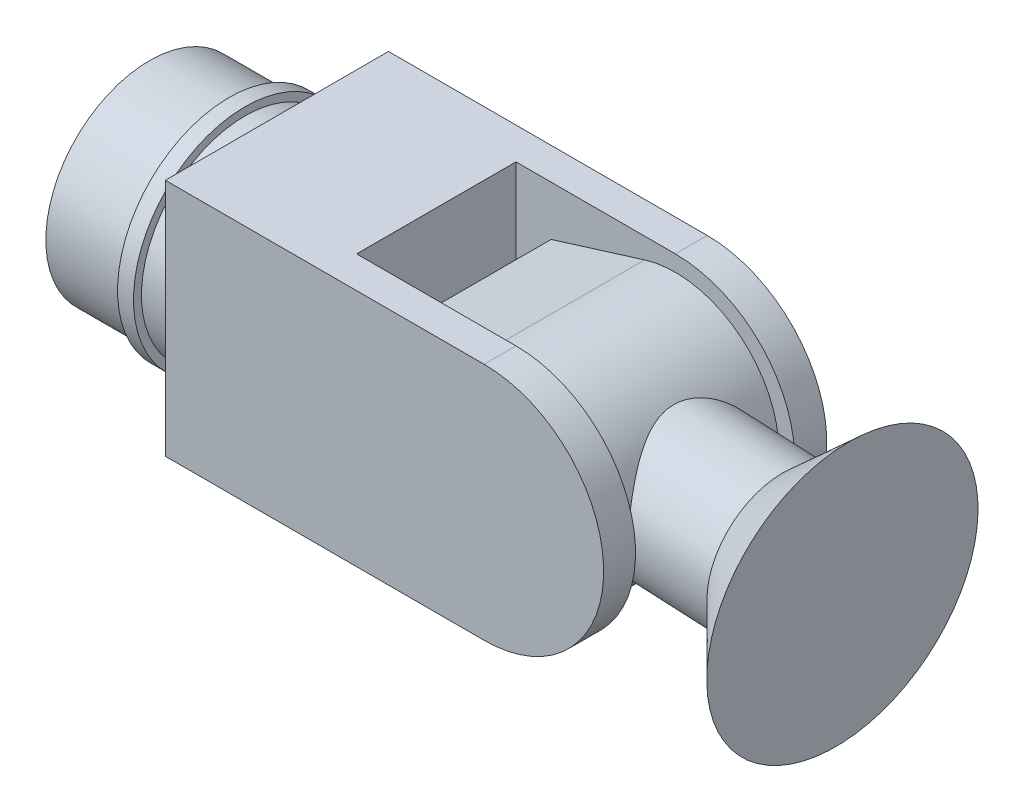
ISO-10303-21;
HEADER;
FILE_DESCRIPTION(('STEP AP214'),'2;1');
FILE_NAME('part.step','',(''),(''),'','','');
FILE_SCHEMA(('AUTOMOTIVE_DESIGN { 1 0 10303 214 1 1 1 1 }'));
ENDSEC;
DATA;
#1=APPLICATION_CONTEXT('core data for automotive mechanical design processes');
#2=APPLICATION_PROTOCOL_DEFINITION('international standard','automotive_design',2000,#1);
#3=PRODUCT_CONTEXT('',#1,'mechanical');
#4=PRODUCT('Part','Part','',(#3));
#5=PRODUCT_RELATED_PRODUCT_CATEGORY('part','',(#4));
#6=PRODUCT_DEFINITION_FORMATION('','',#4);
#7=PRODUCT_DEFINITION_CONTEXT('part definition',#1,'design');
#8=PRODUCT_DEFINITION('design','',#6,#7);
#9=PRODUCT_DEFINITION_SHAPE('','',#8);
#10=(LENGTH_UNIT() NAMED_UNIT(*) SI_UNIT(.MILLI.,.METRE.));
#11=(NAMED_UNIT(*) PLANE_ANGLE_UNIT() SI_UNIT($,.RADIAN.));
#12=(NAMED_UNIT(*) SI_UNIT($,.STERADIAN.) SOLID_ANGLE_UNIT());
#13=UNCERTAINTY_MEASURE_WITH_UNIT(LENGTH_MEASURE(1.E-05),#10,'distance_accuracy_value','');
#14=(GEOMETRIC_REPRESENTATION_CONTEXT(3) GLOBAL_UNCERTAINTY_ASSIGNED_CONTEXT((#13)) GLOBAL_UNIT_ASSIGNED_CONTEXT((#10,
#11,#12)) REPRESENTATION_CONTEXT('',''));
#15=CARTESIAN_POINT('',(0.,0.,0.));
#16=DIRECTION('',(0.,0.,1.));
#17=DIRECTION('',(1.,0.,0.));
#18=AXIS2_PLACEMENT_3D('',#15,#16,#17);
#19=CARTESIAN_POINT('',(8.33823827862884,219.613130495123,295.903382637009));
#20=DIRECTION('',(0.998805605156497,-0.0488606498929882,0.));
#21=DIRECTION('',(0.,0.,-1.));
#22=AXIS2_PLACEMENT_3D('',#19,#20,#21);
#23=CYLINDRICAL_SURFACE('',#22,45.);
#24=CARTESIAN_POINT('',(153.167048637531,212.52823853934,250.903382637009));
#25=CARTESIAN_POINT('',(153.221845720074,213.64837230147,250.903381434481));
#26=CARTESIAN_POINT('',(153.247590342564,214.769910112565,250.945362476761));
#27=CARTESIAN_POINT('',(153.241257132824,217.00654567177,251.11259702764));
#28=CARTESIAN_POINT('',(153.209180621804,218.121643566449,251.237848633472));
#29=CARTESIAN_POINT('',(153.088871896757,220.336936492757,251.56970544904));
#30=CARTESIAN_POINT('',(153.000619944654,221.437126147333,251.776339243885));
#31=CARTESIAN_POINT('',(152.770885842939,223.614145863468,252.267906623606));
#32=CARTESIAN_POINT('',(152.62940266399,224.690975472886,252.552841722571));
#33=CARTESIAN_POINT('',(152.297998754639,226.808970229751,253.195580907304));
#34=CARTESIAN_POINT('',(152.10832112387,227.850285464563,253.553017511861));
#35=CARTESIAN_POINT('',(151.684854828218,229.897032701845,254.33740632832));
#36=CARTESIAN_POINT('',(151.451066457131,230.902464943257,254.76435807722));
#37=CARTESIAN_POINT('',(150.944551164916,232.872800372865,255.683440639925));
#38=CARTESIAN_POINT('',(150.671824588411,233.837703919662,256.175570876865));
#39=CARTESIAN_POINT('',(150.092923633605,235.723377351507,257.220817886029));
#40=CARTESIAN_POINT('',(149.786747619552,236.644145075044,257.773937640789));
#41=CARTESIAN_POINT('',(149.118619402197,238.517276609906,258.988208875215));
#42=CARTESIAN_POINT('',(148.754130878374,239.465351654321,259.65457863646));
#43=CARTESIAN_POINT('',(147.999863550026,241.30311298479,261.050432431087));
#44=CARTESIAN_POINT('',(147.61008355675,242.192796522364,261.779919431648));
#45=CARTESIAN_POINT('',(146.81243328725,243.912663209018,263.299357501769));
#46=CARTESIAN_POINT('',(146.404538836738,244.742762728037,264.089390457597));
#47=CARTESIAN_POINT('',(145.579250910989,246.340037961577,265.72607898131));
#48=CARTESIAN_POINT('',(145.161856884058,247.10721000958,266.572737843337));
#49=CARTESIAN_POINT('',(144.254229176376,248.702839854759,268.470736021062));
#50=CARTESIAN_POINT('',(143.76381137569,249.519153909651,269.532237571356));
#51=CARTESIAN_POINT('',(142.796599665202,251.058316493229,271.727342380619));
#52=CARTESIAN_POINT('',(142.319809213551,251.781141458807,272.860963709757));
#53=CARTESIAN_POINT('',(141.397473549002,253.126705999493,275.196148451316));
#54=CARTESIAN_POINT('',(140.951887798563,253.74957683578,276.397619910212));
#55=CARTESIAN_POINT('',(140.110463471872,254.88890382911,278.866450772945));
#56=CARTESIAN_POINT('',(139.714599225277,255.405414986614,280.133775696015));
#57=CARTESIAN_POINT('',(139.104028448407,256.182460754106,282.330983001727));
#58=CARTESIAN_POINT('',(138.870981870139,256.472933490883,283.245261792911));
#59=CARTESIAN_POINT('',(138.446025126472,256.995085252581,285.099843714654));
#60=CARTESIAN_POINT('',(138.254108283839,257.226773821981,286.040142592935));
#61=CARTESIAN_POINT('',(137.918499787856,257.627688722935,287.940878250375));
#62=CARTESIAN_POINT('',(137.774729850784,257.797016494225,288.901279615514));
#63=CARTESIAN_POINT('',(137.540750248908,258.07080094797,290.837842110724));
#64=CARTESIAN_POINT('',(137.45054056678,258.175257651407,291.814003235697));
#65=CARTESIAN_POINT('',(137.327317978609,258.317607479482,293.780146152212));
#66=CARTESIAN_POINT('',(137.294616708918,258.355137948145,294.770174118562));
#67=CARTESIAN_POINT('',(137.288894548498,258.361717784744,296.750631014103));
#68=CARTESIAN_POINT('',(137.315873546624,258.330767280215,297.741059942543));
#69=CARTESIAN_POINT('',(137.42828217674,258.201015316119,299.7146701613));
#70=CARTESIAN_POINT('',(137.5137474985,258.10217242684,300.697846655516));
#71=CARTESIAN_POINT('',(137.739346343361,257.838588711479,302.648897601684));
#72=CARTESIAN_POINT('',(137.879481050505,257.673846458131,303.616771721741));
#73=CARTESIAN_POINT('',(138.198602000583,257.293405931438,305.472576306656));
#74=CARTESIAN_POINT('',(138.374693671489,257.081433028847,306.361779699561));
#75=CARTESIAN_POINT('',(138.764395457445,256.604712648488,308.117796986227));
#76=CARTESIAN_POINT('',(138.978019422709,256.339945683707,308.984602478767));
#77=CARTESIAN_POINT('',(139.436850576905,255.760374373102,310.693205203702));
#78=CARTESIAN_POINT('',(139.682074527503,255.445543450826,311.534988869957));
#79=CARTESIAN_POINT('',(140.197973255322,254.768702786924,313.19102437891));
#80=CARTESIAN_POINT('',(140.468643998558,254.406700519692,314.005280557704));
#81=CARTESIAN_POINT('',(141.174236141578,253.439861996961,316.017159276689));
#82=CARTESIAN_POINT('',(141.621997110178,252.80593387569,317.196409971527));
#83=CARTESIAN_POINT('',(142.54481711521,251.441755699926,319.486750477401));
#84=CARTESIAN_POINT('',(143.019886848347,250.711467754685,320.597813222361));
#85=CARTESIAN_POINT('',(143.982008640633,249.158426105044,322.751060215018));
#86=CARTESIAN_POINT('',(144.469080133806,248.335513520134,323.79312108758));
#87=CARTESIAN_POINT('',(145.439882302787,246.602335175574,325.803261746572));
#88=CARTESIAN_POINT('',(145.923613384368,245.692080233201,326.771350667759));
#89=CARTESIAN_POINT('',(146.879633396,243.777299860527,328.639774784575));
#90=CARTESIAN_POINT('',(147.351745688142,242.771873992525,329.539278953516));
#91=CARTESIAN_POINT('',(148.266274106531,240.67843666799,331.253737986801));
#92=CARTESIAN_POINT('',(148.708687525462,239.590417701577,332.068685146711));
#93=CARTESIAN_POINT('',(149.550611527243,237.338093722187,333.60581584189));
#94=CARTESIAN_POINT('',(149.950197836393,236.173929422334,334.328163569072));
#95=CARTESIAN_POINT('',(150.695334759313,233.773333836786,335.673715013586));
#96=CARTESIAN_POINT('',(151.040901590704,232.536924394115,336.29694848778));
#97=CARTESIAN_POINT('',(151.597267728695,230.281046504603,337.309303093549));
#98=CARTESIAN_POINT('',(151.820960182663,229.274250988751,337.71969469051));
#99=CARTESIAN_POINT('',(152.223799414807,227.226384862065,338.470949548242));
#100=CARTESIAN_POINT('',(152.402952369109,226.185319026066,338.811822447732));
#101=CARTESIAN_POINT('',(152.712205605582,224.075265465901,339.419850248921));
#102=CARTESIAN_POINT('',(152.842330566621,223.006292079898,339.687042220647));
#103=CARTESIAN_POINT('',(153.050002108883,220.846863162987,340.144369575745));
#104=CARTESIAN_POINT('',(153.127547573021,219.756407176174,340.33450332193));
#105=CARTESIAN_POINT('',(153.227602443969,217.557784977085,340.635494030207));
#106=CARTESIAN_POINT('',(153.249899742768,216.449566899765,340.746044308447));
#107=CARTESIAN_POINT('',(153.237416363806,214.228284360227,340.884946371165));
#108=CARTESIAN_POINT('',(153.202635710496,213.115219900086,340.913298190856));
#109=CARTESIAN_POINT('',(153.075956720562,210.89331879057,340.887348887944));
#110=CARTESIAN_POINT('',(152.984058189601,209.784482155594,340.833047484122));
#111=CARTESIAN_POINT('',(152.74450347277,207.579984728187,340.642657427204));
#112=CARTESIAN_POINT('',(152.596849028026,206.484323525421,340.506571327974));
#113=CARTESIAN_POINT('',(152.259027636293,204.380328721985,340.165398436212));
#114=CARTESIAN_POINT('',(152.071979597465,203.370727039824,339.964993423454));
#115=CARTESIAN_POINT('',(151.654156145175,201.376706403596,339.496443988677));
#116=CARTESIAN_POINT('',(151.423382880053,200.39228621499,339.228302894502));
#117=CARTESIAN_POINT('',(150.921854390586,198.45382231837,338.627368038169));
#118=CARTESIAN_POINT('',(150.651095965266,197.499781049754,338.294569099214));
#119=CARTESIAN_POINT('',(150.073859811748,195.626484438939,337.567769448396));
#120=CARTESIAN_POINT('',(149.767380087482,194.707231044456,337.173765316043));
#121=CARTESIAN_POINT('',(149.099205553343,192.839736974111,336.29651014991));
#122=CARTESIAN_POINT('',(148.735096311008,191.894461039936,335.80879078991));
#123=CARTESIAN_POINT('',(147.976825822131,190.051413495525,334.77109025513));
#124=CARTESIAN_POINT('',(147.582663392674,189.153643757528,334.221106629166));
#125=CARTESIAN_POINT('',(146.77012906624,187.407536314364,333.062583444951));
#126=CARTESIAN_POINT('',(146.351744400219,186.559225163598,332.454012887762));
#127=CARTESIAN_POINT('',(145.497108544985,184.914260304541,331.182130054671));
#128=CARTESIAN_POINT('',(145.060856393846,184.117609383446,330.51881482954));
#129=CARTESIAN_POINT('',(144.101568171815,182.446283199155,329.023302721725));
#130=CARTESIAN_POINT('',(143.576384486197,181.58136063059,328.181563893964));
#131=CARTESIAN_POINT('',(142.520435304287,179.925594334322,326.431217881568));
#132=CARTESIAN_POINT('',(141.989668990805,179.134761624666,325.522600787099));
#133=CARTESIAN_POINT('',(140.933244653654,177.628436061127,323.640954130408));
#134=CARTESIAN_POINT('',(140.407590242469,176.912993405023,322.66788234501));
#135=CARTESIAN_POINT('',(139.373774263341,175.560182197445,320.660205940647));
#136=CARTESIAN_POINT('',(138.86561040015,174.922803373515,319.625609444424));
#137=CARTESIAN_POINT('',(137.936367877653,173.797057820583,317.618283375884));
#138=CARTESIAN_POINT('',(137.511969655608,173.29998658215,316.651971059818));
#139=CARTESIAN_POINT('',(136.697711130354,172.371914901188,314.673914122198));
#140=CARTESIAN_POINT('',(136.307851070061,171.940914923338,313.662169181179));
#141=CARTESIAN_POINT('',(135.57471569221,171.14905815123,311.597179902072));
#142=CARTESIAN_POINT('',(135.231366169699,170.788089218931,310.544005211959));
#143=CARTESIAN_POINT('',(134.602747132855,170.139563699294,308.398398340538));
#144=CARTESIAN_POINT('',(134.317463515528,169.851989281644,307.305975767737));
#145=CARTESIAN_POINT('',(133.863939151061,169.401202818606,305.295545636444));
#146=CARTESIAN_POINT('',(133.68378515476,169.224787429112,304.383176172713));
#147=CARTESIAN_POINT('',(133.375717111522,168.925593841461,302.540958463691));
#148=CARTESIAN_POINT('',(133.247796595751,168.802809001318,301.611112397713));
#149=CARTESIAN_POINT('',(133.048949652946,168.612813905269,299.740569995179));
#150=CARTESIAN_POINT('',(132.97796830004,168.545550089665,298.799885005214));
#151=CARTESIAN_POINT('',(132.895571249922,168.467525658314,296.913523802159));
#152=CARTESIAN_POINT('',(132.884156389014,168.456765835873,295.967847519179));
#153=CARTESIAN_POINT('',(132.921366523714,168.49195048502,294.078320623141));
#154=CARTESIAN_POINT('',(132.970018744197,168.537920668978,293.134471032267));
#155=CARTESIAN_POINT('',(133.125464894386,168.685812909277,291.25606372411));
#156=CARTESIAN_POINT('',(133.232258475552,168.787734630205,290.32150595116));
#157=CARTESIAN_POINT('',(133.500134174803,169.046075849689,288.466716650943));
#158=CARTESIAN_POINT('',(133.661283288417,169.202562610074,287.546504276512));
#159=CARTESIAN_POINT('',(134.032310687367,169.567851684446,285.726551572667));
#160=CARTESIAN_POINT('',(134.242195492804,169.776660998696,284.826814000172));
#161=CARTESIAN_POINT('',(134.773343819498,170.314027950672,282.786656458946));
#162=CARTESIAN_POINT('',(135.109154877607,170.659725855358,281.654514531791));
#163=CARTESIAN_POINT('',(135.837835233957,171.43034117199,279.436503114372));
#164=CARTESIAN_POINT('',(136.230722320734,171.855283293252,278.350648187063));
#165=CARTESIAN_POINT('',(137.060124481442,172.780537574209,276.227349638577));
#166=CARTESIAN_POINT('',(137.496690162193,173.280937509117,275.189964264245));
#167=CARTESIAN_POINT('',(138.400368856929,174.353256876017,273.167023915222));
#168=CARTESIAN_POINT('',(138.867479954801,174.925171823927,272.181465696402));
#169=CARTESIAN_POINT('',(139.831671651305,176.151623345718,270.242053954746));
#170=CARTESIAN_POINT('',(140.3291899356,176.80772840173,269.289411426701));
#171=CARTESIAN_POINT('',(141.333460656508,178.190026857186,267.441629352936));
#172=CARTESIAN_POINT('',(141.840213079559,178.916220153701,266.546489722772));
#173=CARTESIAN_POINT('',(142.853183635548,180.43738236792,264.815751624862));
#174=CARTESIAN_POINT('',(143.359401561775,181.232371919586,263.980171158607));
#175=CARTESIAN_POINT('',(144.361884392916,182.889582676991,262.371863697955));
#176=CARTESIAN_POINT('',(144.858148358758,183.75181018891,261.599142612997));
#177=CARTESIAN_POINT('',(145.910401655256,185.686431951935,260.001100690742));
#178=CARTESIAN_POINT('',(146.463101771211,186.770285286572,259.187422020673));
#179=CARTESIAN_POINT('',(147.529533613347,189.023489200956,257.65751850008));
#180=CARTESIAN_POINT('',(148.043259285584,190.192853007965,256.941308775854));
#181=CARTESIAN_POINT('',(148.774046646776,192.00563656889,255.947520304799));
#182=CARTESIAN_POINT('',(149.01091873896,192.619420173229,255.629793820489));
#183=CARTESIAN_POINT('',(149.469934622859,193.865922271752,255.022138982123));
#184=CARTESIAN_POINT('',(149.692080532982,194.4986380234,254.732206627106));
#185=CARTESIAN_POINT('',(150.120021765075,195.781833314858,254.181389505173));
#186=CARTESIAN_POINT('',(150.325820554628,196.432309047837,253.920498573197));
#187=CARTESIAN_POINT('',(150.719575516504,197.749771185604,253.428921625081));
#188=CARTESIAN_POINT('',(150.907532979416,198.416756391736,253.198233423704));
#189=CARTESIAN_POINT('',(151.367489479912,200.156688599356,252.643637692199));
#190=CARTESIAN_POINT('',(151.625126345433,201.241055989116,252.34310688718));
#191=CARTESIAN_POINT('',(152.087132270665,203.440235831495,251.824554992613));
#192=CARTESIAN_POINT('',(152.291509418105,204.555043633164,251.606521373218));
#193=CARTESIAN_POINT('',(152.6428390693,206.806194842748,251.256371337637));
#194=CARTESIAN_POINT('',(152.78983473207,207.942521388369,251.124190298265));
#195=CARTESIAN_POINT('',(153.023791378971,210.228150784409,250.947696373186));
#196=CARTESIAN_POINT('',(153.110752100082,211.377453691657,250.903383872443));
#197=CARTESIAN_POINT('',(153.167048637531,212.52823853934,250.903382637009));
#198=B_SPLINE_CURVE_WITH_KNOTS('',3,(#24,#25,#26,#27,#28,#29,#30,#31,#32,#33,#34,#35,#36,#37,
#38,#39,#40,#41,#42,#43,#44,#45,#46,#47,#48,#49,#50,#51,#52,#53,#54,#55,#56,#57,#58,#59,#60,#61,
#62,#63,#64,#65,#66,#67,#68,#69,#70,#71,#72,#73,#74,#75,#76,#77,#78,#79,#80,#81,#82,#83,#84,#85,
#86,#87,#88,#89,#90,#91,#92,#93,#94,#95,#96,#97,#98,#99,#100,#101,#102,#103,#104,#105,#106,#107,
#108,#109,#110,#111,#112,#113,#114,#115,#116,#117,#118,#119,#120,#121,#122,#123,#124,#125,#126,
#127,#128,#129,#130,#131,#132,#133,#134,#135,#136,#137,#138,#139,#140,#141,#142,#143,#144,#145,
#146,#147,#148,#149,#150,#151,#152,#153,#154,#155,#156,#157,#158,#159,#160,#161,#162,#163,#164,
#165,#166,#167,#168,#169,#170,#171,#172,#173,#174,#175,#176,#177,#178,#179,#180,#181,#182,#183,
#184,#185,#186,#187,#188,#189,#190,#191,#192,#193,#194,#195,#196,#197),.UNSPECIFIED.,.T.,.F.,(4,
2,2,2,2,2,2,2,2,2,2,2,2,2,2,2,2,2,2,2,2,2,2,2,2,2,2,2,2,2,2,2,2,2,2,2,2,2,2,2,2,2,2,2,2,2,2,2,2,
2,2,2,2,2,2,2,2,2,2,2,2,2,2,2,2,2,2,2,2,2,2,2,2,2,2,2,2,2,2,2,2,2,2,2,2,2,4),(0.,
3.36323892794144,6.72640100710139,10.0907454360665,13.4551549250109,16.8029195613731,
20.1506619010729,23.4983746134034,26.8462511096753,30.4871649037346,34.1282499524345,
37.7743494260164,41.4206611917409,45.6939383064404,49.9682903731881,54.2369825353392,
58.5034617073671,61.4625138492405,64.4210852373371,67.3748225577201,70.3285589227263,
73.2982527376573,76.2679410220407,79.2394430998938,82.2110095388412,85.001141172639,
87.7923045951578,90.584954683776,93.3771628083065,97.6064034875674,101.837312178738,
106.075592113262,110.313347816192,114.596218662803,118.879479402292,123.155037051935,
127.429308626693,130.755998382163,134.082226580387,137.406778235214,140.731400520075,
144.068767009318,147.406132068879,150.743508483461,154.080780688207,157.215791533369,
160.350648386749,163.485756334407,166.621039552604,169.990545063149,173.360183268584,
176.73161428665,180.103227050672,184.047902440152,187.993163521895,191.94103513809,
195.888386692538,199.385185586645,202.88200907258,206.373186157812,209.863514294627,
212.700365177753,215.536864625513,218.370624567028,221.204424293963,224.039508887241,
226.874576485218,229.713151272815,232.55210603787,236.23803941247,239.925124033801,
243.616531168718,247.307706963636,251.081871120678,254.856029735252,258.63132427736,
262.406973327354,266.792058434818,271.177823293658,273.368885604935,275.55963203795,
277.749912517597,279.940034437727,283.398420446896,286.856280978073,290.31153567335,
293.766805506531),.UNSPECIFIED.);
#199=CARTESIAN_POINT('',(153.167048637531,212.52823853934,250.903382637009));
#200=VERTEX_POINT('',#199);
#201=EDGE_CURVE('P0_E124',#200,#200,#198,.T.);
#202=ORIENTED_EDGE('',*,*,#201,.T.);
#203=EDGE_LOOP('',(#202));
#204=FACE_BOUND('',#203,.T.);
#205=CARTESIAN_POINT('',(203.107328895356,210.085206044691,295.903382637009));
#206=DIRECTION('',(0.998805605156496,-0.0488606498929886,0.));
#207=DIRECTION('',(0.0488606498929886,0.998805605156496,0.));
#208=AXIS2_PLACEMENT_3D('',#205,#206,#207);
#209=CIRCLE('',#208,45.);
#210=CARTESIAN_POINT('',(205.30605814054,255.031458276733,295.903382637009));
#211=VERTEX_POINT('',#210);
#212=EDGE_CURVE('P0_E161',#211,#211,#209,.T.);
#213=ORIENTED_EDGE('',*,*,#212,.F.);
#214=EDGE_LOOP('',(#213));
#215=FACE_BOUND('',#214,.T.);
#216=ADVANCED_FACE('P0_F41',(#204,#215),#23,.T.);
#217=CARTESIAN_POINT('',(88.2446843023589,215.704180782385,345.903382637009));
#218=DIRECTION('',(0.,0.,1.));
#219=DIRECTION('',(0.998805605156497,-0.0488606498929882,0.));
#220=AXIS2_PLACEMENT_3D('',#217,#218,#219);
#221=PLANE('',#220);
#222=DIRECTION('',(0.921539080086348,-0.388285621512834,0.));
#223=VECTOR('',#222,1.);
#224=CARTESIAN_POINT('',(6.38580989411962,179.660808567564,345.903382637009));
#225=LINE('',#224,#223);
#226=CARTESIAN_POINT('',(6.38580989411962,179.660808567564,345.903382637009));
#227=VERTEX_POINT('',#226);
#228=CARTESIAN_POINT('',(63.0061189040246,155.804140576772,345.903382637009));
#229=VERTEX_POINT('',#228);
#230=EDGE_CURVE('P0_E94',#227,#229,#225,.T.);
#231=ORIENTED_EDGE('',*,*,#230,.T.);
#232=CARTESIAN_POINT('',(88.2446843023589,215.704180782385,345.903382637009));
#233=DIRECTION('',(0.,0.,1.));
#234=DIRECTION('',(0.998805605156497,-0.0488606498929882,0.));
#235=AXIS2_PLACEMENT_3D('',#232,#233,#234);
#236=CIRCLE('',#235,65.);
#237=CARTESIAN_POINT('',(68.9731445281043,277.781614320904,345.903382637009));
#238=VERTEX_POINT('',#237);
#239=EDGE_CURVE('P0_E88',#229,#238,#236,.T.);
#240=ORIENTED_EDGE('',*,*,#239,.T.);
#241=DIRECTION('',(-0.955037439054149,-0.296485227296224,0.));
#242=VECTOR('',#241,1.);
#243=CARTESIAN_POINT('',(10.2946618855587,259.565256980083,345.903382637009));
#244=LINE('',#243,#242);
#245=CARTESIAN_POINT('',(10.2946618855587,259.565256980083,345.903382637009));
#246=VERTEX_POINT('',#245);
#247=EDGE_CURVE('P0_E92',#238,#246,#244,.T.);
#248=ORIENTED_EDGE('',*,*,#247,.T.);
#249=DIRECTION('',(-0.0488606498929882,-0.998805605156497,0.));
#250=VECTOR('',#249,1.);
#251=CARTESIAN_POINT('',(10.2946618855587,259.565256980083,345.903382637009));
#252=LINE('',#251,#250);
#253=EDGE_CURVE('P0_E58',#246,#227,#252,.T.);
#254=ORIENTED_EDGE('',*,*,#253,.T.);
#255=EDGE_LOOP('',(#231,#240,#248,#254));
#256=FACE_BOUND('',#255,.T.);
#257=CARTESIAN_POINT('',(88.2446843023589,215.704180782385,345.903382637009));
#258=DIRECTION('',(0.,0.,1.));
#259=DIRECTION('',(0.998805605156497,-0.0488606498929882,0.));
#260=AXIS2_PLACEMENT_3D('',#257,#258,#259);
#261=CIRCLE('',#260,50.);
#262=CARTESIAN_POINT('',(138.184964560184,213.261148287735,345.903382637009));
#263=VERTEX_POINT('',#262);
#264=EDGE_CURVE('P0_E109',#263,#263,#261,.T.);
#265=ORIENTED_EDGE('',*,*,#264,.F.);
#266=EDGE_LOOP('',(#265));
#267=FACE_BOUND('',#266,.T.);
#268=ADVANCED_FACE('P0_F89',(#256,#267),#221,.T.);
#269=CARTESIAN_POINT('',(88.2446843023589,215.704180782385,245.903382637009));
#270=DIRECTION('',(0.,0.,1.));
#271=DIRECTION('',(0.998805605156497,-0.0488606498929882,0.));
#272=AXIS2_PLACEMENT_3D('',#269,#270,#271);
#273=PLANE('',#272);
#274=DIRECTION('',(0.921539080086348,-0.388285621512834,0.));
#275=VECTOR('',#274,1.);
#276=CARTESIAN_POINT('',(6.38580989411962,179.660808567564,245.903382637009));
#277=LINE('',#276,#275);
#278=CARTESIAN_POINT('',(6.38580989411962,179.660808567564,245.903382637009));
#279=VERTEX_POINT('',#278);
#280=CARTESIAN_POINT('',(63.0061189040246,155.804140576772,245.903382637009));
#281=VERTEX_POINT('',#280);
#282=EDGE_CURVE('P0_E106',#279,#281,#277,.T.);
#283=ORIENTED_EDGE('',*,*,#282,.F.);
#284=DIRECTION('',(-0.0488606498929882,-0.998805605156497,0.));
#285=VECTOR('',#284,1.);
#286=CARTESIAN_POINT('',(10.2946618855587,259.565256980083,245.903382637009));
#287=LINE('',#286,#285);
#288=CARTESIAN_POINT('',(10.2946618855587,259.565256980083,245.903382637009));
#289=VERTEX_POINT('',#288);
#290=EDGE_CURVE('P0_E81',#289,#279,#287,.T.);
#291=ORIENTED_EDGE('',*,*,#290,.F.);
#292=DIRECTION('',(-0.955037439054149,-0.296485227296224,0.));
#293=VECTOR('',#292,1.);
#294=CARTESIAN_POINT('',(10.2946618855587,259.565256980083,245.903382637009));
#295=LINE('',#294,#293);
#296=CARTESIAN_POINT('',(68.9731445281043,277.781614320904,245.903382637009));
#297=VERTEX_POINT('',#296);
#298=EDGE_CURVE('P0_E75',#297,#289,#295,.T.);
#299=ORIENTED_EDGE('',*,*,#298,.F.);
#300=CARTESIAN_POINT('',(88.2446843023589,215.704180782385,245.903382637009));
#301=DIRECTION('',(0.,0.,1.));
#302=DIRECTION('',(0.998805605156497,-0.0488606498929882,0.));
#303=AXIS2_PLACEMENT_3D('',#300,#301,#302);
#304=CIRCLE('',#303,65.);
#305=EDGE_CURVE('P0_E98',#281,#297,#304,.T.);
#306=ORIENTED_EDGE('',*,*,#305,.F.);
#307=EDGE_LOOP('',(#283,#291,#299,#306));
#308=FACE_BOUND('',#307,.T.);
#309=CARTESIAN_POINT('',(88.2446843023589,215.704180782385,245.903382637009));
#310=DIRECTION('',(0.,0.,1.));
#311=DIRECTION('',(0.998805605156497,-0.0488606498929882,0.));
#312=AXIS2_PLACEMENT_3D('',#309,#310,#311);
#313=CIRCLE('',#312,50.);
#314=CARTESIAN_POINT('',(138.184964560184,213.261148287735,245.903382637009));
#315=VERTEX_POINT('',#314);
#316=EDGE_CURVE('P0_E121',#315,#315,#313,.T.);
#317=ORIENTED_EDGE('',*,*,#316,.T.);
#318=EDGE_LOOP('',(#317));
#319=FACE_BOUND('',#318,.T.);
#320=ADVANCED_FACE('P0_F117',(#308,#319),#273,.F.);
#321=CARTESIAN_POINT('',(6.38580989411962,179.660808567564,345.903382637009));
#322=DIRECTION('',(0.388285621512834,0.921539080086348,0.));
#323=DIRECTION('',(-0.921539080086348,0.388285621512834,0.));
#324=AXIS2_PLACEMENT_3D('',#321,#322,#323);
#325=PLANE('',#324);
#326=ORIENTED_EDGE('',*,*,#282,.T.);
#327=DIRECTION('',(0.,0.,-1.));
#328=VECTOR('',#327,1.);
#329=CARTESIAN_POINT('',(63.0061189040246,155.804140576772,345.903382637009));
#330=LINE('',#329,#328);
#331=EDGE_CURVE('P0_E11',#229,#281,#330,.T.);
#332=ORIENTED_EDGE('',*,*,#331,.F.);
#333=ORIENTED_EDGE('',*,*,#230,.F.);
#334=DIRECTION('',(0.,0.,-1.));
#335=VECTOR('',#334,1.);
#336=CARTESIAN_POINT('',(6.38580989411962,179.660808567564,345.903382637009));
#337=LINE('',#336,#335);
#338=EDGE_CURVE('P0_E102',#227,#279,#337,.T.);
#339=ORIENTED_EDGE('',*,*,#338,.T.);
#340=EDGE_LOOP('',(#326,#332,#333,#339));
#341=FACE_BOUND('',#340,.T.);
#342=ADVANCED_FACE('P0_F43',(#341),#325,.F.);
#343=CARTESIAN_POINT('',(88.2446843023589,215.704180782385,345.903382637009));
#344=DIRECTION('',(0.,0.,-1.));
#345=DIRECTION('',(-0.998805605156497,0.0488606498929882,0.));
#346=AXIS2_PLACEMENT_3D('',#343,#344,#345);
#347=CYLINDRICAL_SURFACE('',#346,65.);
#348=ORIENTED_EDGE('',*,*,#201,.F.);
#349=EDGE_LOOP('',(#348));
#350=FACE_BOUND('',#349,.T.);
#351=ORIENTED_EDGE('',*,*,#305,.T.);
#352=DIRECTION('',(0.,0.,-1.));
#353=VECTOR('',#352,1.);
#354=CARTESIAN_POINT('',(68.9731445281043,277.781614320904,345.903382637009));
#355=LINE('',#354,#353);
#356=EDGE_CURVE('P0_E50',#238,#297,#355,.T.);
#357=ORIENTED_EDGE('',*,*,#356,.F.);
#358=ORIENTED_EDGE('',*,*,#239,.F.);
#359=ORIENTED_EDGE('',*,*,#331,.T.);
#360=EDGE_LOOP('',(#351,#357,#358,#359));
#361=FACE_BOUND('',#360,.T.);
#362=ADVANCED_FACE('P0_F97',(#350,#361),#347,.T.);
#363=CARTESIAN_POINT('',(10.2946618855587,259.565256980083,345.903382637009));
#364=DIRECTION('',(0.296485227296224,-0.955037439054149,0.));
#365=DIRECTION('',(0.955037439054149,0.296485227296224,0.));
#366=AXIS2_PLACEMENT_3D('',#363,#364,#365);
#367=PLANE('',#366);
#368=ORIENTED_EDGE('',*,*,#298,.T.);
#369=DIRECTION('',(0.,0.,-1.));
#370=VECTOR('',#369,1.);
#371=CARTESIAN_POINT('',(10.2946618855587,259.565256980083,345.903382637009));
#372=LINE('',#371,#370);
#373=EDGE_CURVE('P0_E99',#246,#289,#372,.T.);
#374=ORIENTED_EDGE('',*,*,#373,.F.);
#375=ORIENTED_EDGE('',*,*,#247,.F.);
#376=ORIENTED_EDGE('',*,*,#356,.T.);
#377=EDGE_LOOP('',(#368,#374,#375,#376));
#378=FACE_BOUND('',#377,.T.);
#379=ADVANCED_FACE('P0_F100',(#378),#367,.F.);
#380=CARTESIAN_POINT('',(10.2946618855587,259.565256980083,345.903382637009));
#381=DIRECTION('',(0.998805605156497,-0.0488606498929882,0.));
#382=DIRECTION('',(0.,0.,-1.));
#383=AXIS2_PLACEMENT_3D('',#380,#381,#382);
#384=PLANE('',#383);
#385=ORIENTED_EDGE('',*,*,#290,.T.);
#386=ORIENTED_EDGE('',*,*,#338,.F.);
#387=ORIENTED_EDGE('',*,*,#253,.F.);
#388=ORIENTED_EDGE('',*,*,#373,.T.);
#389=EDGE_LOOP('',(#385,#386,#387,#388));
#390=FACE_BOUND('',#389,.T.);
#391=ADVANCED_FACE('P0_F114',(#390),#384,.F.);
#392=CARTESIAN_POINT('',(88.2446843023589,215.704180782385,345.903382637009));
#393=DIRECTION('',(0.,0.,-1.));
#394=DIRECTION('',(-0.998805605156497,0.0488606498929882,0.));
#395=AXIS2_PLACEMENT_3D('',#392,#393,#394);
#396=CYLINDRICAL_SURFACE('',#395,50.);
#397=ORIENTED_EDGE('',*,*,#264,.T.);
#398=EDGE_LOOP('',(#397));
#399=FACE_BOUND('',#398,.T.);
#400=ORIENTED_EDGE('',*,*,#316,.F.);
#401=EDGE_LOOP('',(#400));
#402=FACE_BOUND('',#401,.T.);
#403=ADVANCED_FACE('P0_F144',(#399,#402),#396,.F.);
#404=CARTESIAN_POINT('',(203.107328895356,210.085206044691,295.903382637009));
#405=DIRECTION('',(0.998805605156496,-0.0488606498929886,0.));
#406=DIRECTION('',(0.0488606498929886,0.998805605156496,0.));
#407=AXIS2_PLACEMENT_3D('',#404,#405,#406);
#408=CONICAL_SURFACE('',#407,45.,0.78539816339745);
#409=CARTESIAN_POINT('',(243.059553101616,208.130780048971,295.903382637009));
#410=DIRECTION('',(0.998805605156496,-0.0488606498929886,0.));
#411=DIRECTION('',(0.0488606498929886,0.998805605156496,0.));
#412=AXIS2_PLACEMENT_3D('',#409,#410,#411);
#413=CIRCLE('',#412,85.0000000000001);
#414=CARTESIAN_POINT('',(247.21270834252,293.029256487274,295.903382637009));
#415=VERTEX_POINT('',#414);
#416=EDGE_CURVE('P0_E134',#415,#415,#413,.T.);
#417=ORIENTED_EDGE('',*,*,#416,.F.);
#418=EDGE_LOOP('',(#417));
#419=FACE_BOUND('',#418,.T.);
#420=ORIENTED_EDGE('',*,*,#212,.T.);
#421=EDGE_LOOP('',(#420));
#422=FACE_BOUND('',#421,.T.);
#423=ADVANCED_FACE('P0_F140',(#419,#422),#408,.T.);
#424=CARTESIAN_POINT('',(243.059553101616,208.130780048971,295.903382637009));
#425=DIRECTION('',(0.998805605156496,-0.0488606498929886,0.));
#426=DIRECTION('',(0.0488606498929886,0.998805605156496,0.));
#427=AXIS2_PLACEMENT_3D('',#424,#425,#426);
#428=PLANE('',#427);
#429=ORIENTED_EDGE('',*,*,#416,.T.);
#430=EDGE_LOOP('',(#429));
#431=FACE_BOUND('',#430,.T.);
#432=ADVANCED_FACE('P0_F143',(#431),#428,.T.);
#433=CLOSED_SHELL('',(#216,#268,#320,#342,#362,#379,#391,#403,#423,#432));
#434=MANIFOLD_SOLID_BREP('P0_B2',#433);
#435=CARTESIAN_POINT('',(-191.755315697641,290.704180782385,225.903382637009));
#436=DIRECTION('',(1.,0.,0.));
#437=DIRECTION('',(0.,0.,-1.));
#438=AXIS2_PLACEMENT_3D('',#435,#436,#437);
#439=PLANE('',#438);
#440=CARTESIAN_POINT('',(-191.755315697641,215.704180782385,295.903382637009));
#441=DIRECTION('',(1.,0.,0.));
#442=DIRECTION('',(0.,0.,-1.));
#443=AXIS2_PLACEMENT_3D('',#440,#441,#442);
#444=CIRCLE('',#443,65.);
#445=CARTESIAN_POINT('',(-191.755315697641,215.704180782385,230.903382637009));
#446=VERTEX_POINT('',#445);
#447=EDGE_CURVE('P1_E135',#446,#446,#444,.T.);
#448=ORIENTED_EDGE('',*,*,#447,.F.);
#449=EDGE_LOOP('',(#448));
#450=FACE_BOUND('',#449,.T.);
#451=ADVANCED_FACE('P1_F16',(#450),#439,.F.);
#452=CARTESIAN_POINT('',(88.2446843023589,215.704180782385,375.905382637009));
#453=DIRECTION('',(0.,0.,-1.));
#454=DIRECTION('',(-1.,0.,0.));
#455=AXIS2_PLACEMENT_3D('',#452,#453,#454);
#456=CYLINDRICAL_SURFACE('',#455,50.);
#457=CARTESIAN_POINT('',(88.2446843023589,215.704180782385,245.903382637009));
#458=DIRECTION('',(0.,0.,1.));
#459=DIRECTION('',(1.,0.,0.));
#460=AXIS2_PLACEMENT_3D('',#457,#458,#459);
#461=CIRCLE('',#460,50.);
#462=CARTESIAN_POINT('',(138.244684302359,215.704180782385,245.903382637009));
#463=VERTEX_POINT('',#462);
#464=EDGE_CURVE('P1_E218',#463,#463,#461,.T.);
#465=ORIENTED_EDGE('',*,*,#464,.T.);
#466=EDGE_LOOP('',(#465));
#467=FACE_BOUND('',#466,.T.);
#468=CARTESIAN_POINT('',(88.2446843023589,215.704180782385,345.903382637009));
#469=DIRECTION('',(0.,0.,1.));
#470=DIRECTION('',(1.,0.,0.));
#471=AXIS2_PLACEMENT_3D('',#468,#469,#470);
#472=CIRCLE('',#471,50.);
#473=CARTESIAN_POINT('',(138.244684302359,215.704180782385,345.903382637009));
#474=VERTEX_POINT('',#473);
#475=EDGE_CURVE('P1_E11',#474,#474,#472,.F.);
#476=ORIENTED_EDGE('',*,*,#475,.T.);
#477=EDGE_LOOP('',(#476));
#478=FACE_BOUND('',#477,.T.);
#479=ADVANCED_FACE('P1_F153',(#467,#478),#456,.T.);
#480=CARTESIAN_POINT('',(88.2446843023589,215.704180782385,365.903382637009));
#481=DIRECTION('',(0.,0.,-1.));
#482=DIRECTION('',(-1.,0.,0.));
#483=AXIS2_PLACEMENT_3D('',#480,#481,#482);
#484=CYLINDRICAL_SURFACE('',#483,75.);
#485=DIRECTION('',(0.,0.,-1.));
#486=VECTOR('',#485,1.);
#487=CARTESIAN_POINT('',(88.2446843023589,140.704180782385,365.903382637009));
#488=LINE('',#487,#486);
#489=CARTESIAN_POINT('',(88.2446843023589,140.704180782385,365.903382637009));
#490=VERTEX_POINT('',#489);
#491=CARTESIAN_POINT('',(88.2446843023589,140.704180782385,345.903382637009));
#492=VERTEX_POINT('',#491);
#493=EDGE_CURVE('P1_E263',#490,#492,#488,.T.);
#494=ORIENTED_EDGE('',*,*,#493,.T.);
#495=CARTESIAN_POINT('',(88.2446843023589,215.704180782385,345.903382637009));
#496=DIRECTION('',(0.,0.,1.));
#497=DIRECTION('',(1.,0.,0.));
#498=AXIS2_PLACEMENT_3D('',#495,#496,#497);
#499=CIRCLE('',#498,75.);
#500=CARTESIAN_POINT('',(88.2446843023589,290.704180782385,345.903382637009));
#501=VERTEX_POINT('',#500);
#502=EDGE_CURVE('P1_E31',#492,#501,#499,.T.);
#503=ORIENTED_EDGE('',*,*,#502,.T.);
#504=DIRECTION('',(0.,0.,-1.));
#505=VECTOR('',#504,1.);
#506=CARTESIAN_POINT('',(88.2446843023589,290.704180782385,365.903382637009));
#507=LINE('',#506,#505);
#508=CARTESIAN_POINT('',(88.2446843023589,290.704180782385,365.903382637009));
#509=VERTEX_POINT('',#508);
#510=EDGE_CURVE('P1_E116',#509,#501,#507,.T.);
#511=ORIENTED_EDGE('',*,*,#510,.F.);
#512=CARTESIAN_POINT('',(88.2446843023589,215.704180782385,365.903382637009));
#513=DIRECTION('',(0.,0.,1.));
#514=DIRECTION('',(1.,0.,0.));
#515=AXIS2_PLACEMENT_3D('',#512,#513,#514);
#516=CIRCLE('',#515,75.);
#517=EDGE_CURVE('P1_E242',#490,#509,#516,.T.);
#518=ORIENTED_EDGE('',*,*,#517,.F.);
#519=EDGE_LOOP('',(#494,#503,#511,#518));
#520=FACE_BOUND('',#519,.T.);
#521=ADVANCED_FACE('P1_F158',(#520),#484,.T.);
#522=CARTESIAN_POINT('',(88.2446843023589,215.704180782385,345.903382637009));
#523=DIRECTION('',(0.,0.,1.));
#524=DIRECTION('',(1.,0.,0.));
#525=AXIS2_PLACEMENT_3D('',#522,#523,#524);
#526=PLANE('',#525);
#527=ORIENTED_EDGE('',*,*,#475,.F.);
#528=EDGE_LOOP('',(#527));
#529=FACE_BOUND('',#528,.T.);
#530=ORIENTED_EDGE('',*,*,#502,.F.);
#531=DIRECTION('',(1.,0.,0.));
#532=VECTOR('',#531,1.);
#533=CARTESIAN_POINT('',(-11.755315697641,140.704180782385,345.903382637009));
#534=LINE('',#533,#532);
#535=CARTESIAN_POINT('',(-11.755315697641,140.704180782385,345.903382637009));
#536=VERTEX_POINT('',#535);
#537=EDGE_CURVE('P1_E102',#536,#492,#534,.T.);
#538=ORIENTED_EDGE('',*,*,#537,.F.);
#539=DIRECTION('',(0.,-1.,0.));
#540=VECTOR('',#539,1.);
#541=CARTESIAN_POINT('',(-11.7553156976411,290.704180782385,345.903382637009));
#542=LINE('',#541,#540);
#543=CARTESIAN_POINT('',(-11.7553156976411,290.704180782385,345.903382637009));
#544=VERTEX_POINT('',#543);
#545=EDGE_CURVE('P1_E231',#544,#536,#542,.T.);
#546=ORIENTED_EDGE('',*,*,#545,.F.);
#547=DIRECTION('',(-1.,0.,0.));
#548=VECTOR('',#547,1.);
#549=CARTESIAN_POINT('',(88.2446843023589,290.704180782385,345.903382637009));
#550=LINE('',#549,#548);
#551=EDGE_CURVE('P1_E222',#501,#544,#550,.T.);
#552=ORIENTED_EDGE('',*,*,#551,.F.);
#553=EDGE_LOOP('',(#530,#538,#546,#552));
#554=FACE_BOUND('',#553,.T.);
#555=ADVANCED_FACE('P1_F186',(#529,#554),#526,.F.);
#556=CARTESIAN_POINT('',(-11.7553156976411,290.704180782385,245.903382637009));
#557=DIRECTION('',(-1.,0.,0.));
#558=DIRECTION('',(0.,-1.,0.));
#559=AXIS2_PLACEMENT_3D('',#556,#557,#558);
#560=PLANE('',#559);
#561=ORIENTED_EDGE('',*,*,#545,.T.);
#562=DIRECTION('',(0.,0.,1.));
#563=VECTOR('',#562,1.);
#564=CARTESIAN_POINT('',(-11.755315697641,140.704180782385,245.903382637009));
#565=LINE('',#564,#563);
#566=CARTESIAN_POINT('',(-11.755315697641,140.704180782385,245.903382637009));
#567=VERTEX_POINT('',#566);
#568=EDGE_CURVE('P1_E236',#567,#536,#565,.T.);
#569=ORIENTED_EDGE('',*,*,#568,.F.);
#570=DIRECTION('',(0.,-1.,0.));
#571=VECTOR('',#570,1.);
#572=CARTESIAN_POINT('',(-11.7553156976411,290.704180782385,245.903382637009));
#573=LINE('',#572,#571);
#574=CARTESIAN_POINT('',(-11.7553156976411,290.704180782385,245.903382637009));
#575=VERTEX_POINT('',#574);
#576=EDGE_CURVE('P1_E110',#575,#567,#573,.T.);
#577=ORIENTED_EDGE('',*,*,#576,.F.);
#578=DIRECTION('',(0.,0.,1.));
#579=VECTOR('',#578,1.);
#580=CARTESIAN_POINT('',(-11.7553156976411,290.704180782385,245.903382637009));
#581=LINE('',#580,#579);
#582=EDGE_CURVE('P1_E108',#575,#544,#581,.T.);
#583=ORIENTED_EDGE('',*,*,#582,.T.);
#584=EDGE_LOOP('',(#561,#569,#577,#583));
#585=FACE_BOUND('',#584,.T.);
#586=ADVANCED_FACE('P1_F204',(#585),#560,.F.);
#587=CARTESIAN_POINT('',(88.2446843023589,215.704180782385,245.903382637009));
#588=DIRECTION('',(0.,0.,1.));
#589=DIRECTION('',(1.,0.,0.));
#590=AXIS2_PLACEMENT_3D('',#587,#588,#589);
#591=PLANE('',#590);
#592=ORIENTED_EDGE('',*,*,#464,.F.);
#593=EDGE_LOOP('',(#592));
#594=FACE_BOUND('',#593,.T.);
#595=CARTESIAN_POINT('',(88.2446843023589,215.704180782385,245.903382637009));
#596=DIRECTION('',(0.,0.,1.));
#597=DIRECTION('',(1.,0.,0.));
#598=AXIS2_PLACEMENT_3D('',#595,#596,#597);
#599=CIRCLE('',#598,75.);
#600=CARTESIAN_POINT('',(88.2446843023589,140.704180782385,245.903382637009));
#601=VERTEX_POINT('',#600);
#602=CARTESIAN_POINT('',(88.2446843023589,290.704180782385,245.903382637009));
#603=VERTEX_POINT('',#602);
#604=EDGE_CURVE('P1_E92',#601,#603,#599,.T.);
#605=ORIENTED_EDGE('',*,*,#604,.T.);
#606=DIRECTION('',(-1.,0.,0.));
#607=VECTOR('',#606,1.);
#608=CARTESIAN_POINT('',(88.2446843023589,290.704180782385,245.903382637009));
#609=LINE('',#608,#607);
#610=EDGE_CURVE('P1_E96',#603,#575,#609,.T.);
#611=ORIENTED_EDGE('',*,*,#610,.T.);
#612=ORIENTED_EDGE('',*,*,#576,.T.);
#613=DIRECTION('',(1.,0.,0.));
#614=VECTOR('',#613,1.);
#615=CARTESIAN_POINT('',(-11.755315697641,140.704180782385,245.903382637009));
#616=LINE('',#615,#614);
#617=EDGE_CURVE('P1_E99',#567,#601,#616,.T.);
#618=ORIENTED_EDGE('',*,*,#617,.T.);
#619=EDGE_LOOP('',(#605,#611,#612,#618));
#620=FACE_BOUND('',#619,.T.);
#621=ADVANCED_FACE('P1_F94',(#594,#620),#591,.T.);
#622=ORIENTED_EDGE('',*,*,#604,.F.);
#623=CARTESIAN_POINT('',(88.2446843023589,140.704180782385,225.903382637009));
#624=VERTEX_POINT('',#623);
#625=EDGE_CURVE('P1_E62',#601,#624,#488,.T.);
#626=ORIENTED_EDGE('',*,*,#625,.T.);
#627=CARTESIAN_POINT('',(88.2446843023589,215.704180782385,225.903382637009));
#628=DIRECTION('',(0.,0.,1.));
#629=DIRECTION('',(1.,0.,0.));
#630=AXIS2_PLACEMENT_3D('',#627,#628,#629);
#631=CIRCLE('',#630,75.);
#632=CARTESIAN_POINT('',(88.2446843023589,290.704180782385,225.903382637009));
#633=VERTEX_POINT('',#632);
#634=EDGE_CURVE('P1_E114',#624,#633,#631,.T.);
#635=ORIENTED_EDGE('',*,*,#634,.T.);
#636=EDGE_CURVE('P1_E105',#603,#633,#507,.T.);
#637=ORIENTED_EDGE('',*,*,#636,.F.);
#638=EDGE_LOOP('',(#622,#626,#635,#637));
#639=FACE_BOUND('',#638,.T.);
#640=ADVANCED_FACE('P1_F112',(#639),#484,.T.);
#641=CARTESIAN_POINT('',(88.2446843023589,290.704180782385,365.903382637009));
#642=DIRECTION('',(0.,-1.,0.));
#643=DIRECTION('',(1.,0.,0.));
#644=AXIS2_PLACEMENT_3D('',#641,#642,#643);
#645=PLANE('',#644);
#646=ORIENTED_EDGE('',*,*,#610,.F.);
#647=ORIENTED_EDGE('',*,*,#636,.T.);
#648=DIRECTION('',(-1.,0.,0.));
#649=VECTOR('',#648,1.);
#650=CARTESIAN_POINT('',(88.2446843023589,290.704180782385,225.903382637009));
#651=LINE('',#650,#649);
#652=CARTESIAN_POINT('',(-111.755315697641,290.704180782385,225.903382637009));
#653=VERTEX_POINT('',#652);
#654=EDGE_CURVE('P1_E255',#633,#653,#651,.T.);
#655=ORIENTED_EDGE('',*,*,#654,.T.);
#656=DIRECTION('',(0.,0.,-1.));
#657=VECTOR('',#656,1.);
#658=CARTESIAN_POINT('',(-111.755315697641,290.704180782385,365.903382637009));
#659=LINE('',#658,#657);
#660=CARTESIAN_POINT('',(-111.755315697641,290.704180782385,365.903382637009));
#661=VERTEX_POINT('',#660);
#662=EDGE_CURVE('P1_E117',#661,#653,#659,.T.);
#663=ORIENTED_EDGE('',*,*,#662,.F.);
#664=DIRECTION('',(-1.,0.,0.));
#665=VECTOR('',#664,1.);
#666=CARTESIAN_POINT('',(88.2446843023589,290.704180782385,365.903382637009));
#667=LINE('',#666,#665);
#668=EDGE_CURVE('P1_E70',#509,#661,#667,.T.);
#669=ORIENTED_EDGE('',*,*,#668,.F.);
#670=ORIENTED_EDGE('',*,*,#510,.T.);
#671=ORIENTED_EDGE('',*,*,#551,.T.);
#672=ORIENTED_EDGE('',*,*,#582,.F.);
#673=EDGE_LOOP('',(#646,#647,#655,#663,#669,#670,#671,#672));
#674=FACE_BOUND('',#673,.T.);
#675=ADVANCED_FACE('P1_F104',(#674),#645,.F.);
#676=CARTESIAN_POINT('',(88.2446843023589,215.704180782385,365.903382637009));
#677=DIRECTION('',(0.,0.,1.));
#678=DIRECTION('',(1.,0.,0.));
#679=AXIS2_PLACEMENT_3D('',#676,#677,#678);
#680=PLANE('',#679);
#681=ORIENTED_EDGE('',*,*,#517,.T.);
#682=ORIENTED_EDGE('',*,*,#668,.T.);
#683=DIRECTION('',(0.,-1.,0.));
#684=VECTOR('',#683,1.);
#685=CARTESIAN_POINT('',(-111.755315697641,290.704180782385,365.903382637009));
#686=LINE('',#685,#684);
#687=CARTESIAN_POINT('',(-111.755315697641,140.704180782385,365.903382637009));
#688=VERTEX_POINT('',#687);
#689=EDGE_CURVE('P1_E248',#661,#688,#686,.T.);
#690=ORIENTED_EDGE('',*,*,#689,.T.);
#691=DIRECTION('',(1.,0.,0.));
#692=VECTOR('',#691,1.);
#693=CARTESIAN_POINT('',(-111.755315697641,140.704180782385,365.903382637009));
#694=LINE('',#693,#692);
#695=EDGE_CURVE('P1_E40',#688,#490,#694,.T.);
#696=ORIENTED_EDGE('',*,*,#695,.T.);
#697=EDGE_LOOP('',(#681,#682,#690,#696));
#698=FACE_BOUND('',#697,.T.);
#699=ADVANCED_FACE('P1_F190',(#698),#680,.T.);
#700=CARTESIAN_POINT('',(-111.755315697641,140.704180782385,365.903382637009));
#701=DIRECTION('',(0.,1.,0.));
#702=DIRECTION('',(-1.,0.,0.));
#703=AXIS2_PLACEMENT_3D('',#700,#701,#702);
#704=PLANE('',#703);
#705=ORIENTED_EDGE('',*,*,#617,.F.);
#706=ORIENTED_EDGE('',*,*,#568,.T.);
#707=ORIENTED_EDGE('',*,*,#537,.T.);
#708=ORIENTED_EDGE('',*,*,#493,.F.);
#709=ORIENTED_EDGE('',*,*,#695,.F.);
#710=DIRECTION('',(0.,0.,-1.));
#711=VECTOR('',#710,1.);
#712=CARTESIAN_POINT('',(-111.755315697641,140.704180782385,365.903382637009));
#713=LINE('',#712,#711);
#714=CARTESIAN_POINT('',(-111.755315697641,140.704180782385,225.903382637009));
#715=VERTEX_POINT('',#714);
#716=EDGE_CURVE('P1_E124',#688,#715,#713,.T.);
#717=ORIENTED_EDGE('',*,*,#716,.T.);
#718=DIRECTION('',(1.,0.,0.));
#719=VECTOR('',#718,1.);
#720=CARTESIAN_POINT('',(-111.755315697641,140.704180782385,225.903382637009));
#721=LINE('',#720,#719);
#722=EDGE_CURVE('P1_E245',#715,#624,#721,.T.);
#723=ORIENTED_EDGE('',*,*,#722,.T.);
#724=ORIENTED_EDGE('',*,*,#625,.F.);
#725=EDGE_LOOP('',(#705,#706,#707,#708,#709,#717,#723,#724));
#726=FACE_BOUND('',#725,.T.);
#727=ADVANCED_FACE('P1_F195',(#726),#704,.F.);
#728=CARTESIAN_POINT('',(88.2446843023589,215.704180782385,225.903382637009));
#729=DIRECTION('',(0.,0.,1.));
#730=DIRECTION('',(1.,0.,0.));
#731=AXIS2_PLACEMENT_3D('',#728,#729,#730);
#732=PLANE('',#731);
#733=ORIENTED_EDGE('',*,*,#634,.F.);
#734=ORIENTED_EDGE('',*,*,#722,.F.);
#735=DIRECTION('',(0.,-1.,0.));
#736=VECTOR('',#735,1.);
#737=CARTESIAN_POINT('',(-111.755315697641,290.704180782385,225.903382637009));
#738=LINE('',#737,#736);
#739=EDGE_CURVE('P1_E258',#653,#715,#738,.T.);
#740=ORIENTED_EDGE('',*,*,#739,.F.);
#741=ORIENTED_EDGE('',*,*,#654,.F.);
#742=EDGE_LOOP('',(#733,#734,#740,#741));
#743=FACE_BOUND('',#742,.T.);
#744=ADVANCED_FACE('P1_F193',(#743),#732,.F.);
#745=CARTESIAN_POINT('',(-111.755315697641,290.704180782385,365.903382637009));
#746=DIRECTION('',(1.,0.,0.));
#747=DIRECTION('',(0.,1.,0.));
#748=AXIS2_PLACEMENT_3D('',#745,#746,#747);
#749=PLANE('',#748);
#750=CARTESIAN_POINT('',(-111.755315697641,215.704180782385,295.903382637009));
#751=DIRECTION('',(1.,0.,0.));
#752=DIRECTION('',(0.,0.,-1.));
#753=AXIS2_PLACEMENT_3D('',#750,#751,#752);
#754=CIRCLE('',#753,65.);
#755=CARTESIAN_POINT('',(-111.755315697641,215.704180782385,230.903382637009));
#756=VERTEX_POINT('',#755);
#757=EDGE_CURVE('P1_E122',#756,#756,#754,.T.);
#758=ORIENTED_EDGE('',*,*,#757,.T.);
#759=EDGE_LOOP('',(#758));
#760=FACE_BOUND('',#759,.T.);
#761=ORIENTED_EDGE('',*,*,#739,.T.);
#762=ORIENTED_EDGE('',*,*,#716,.F.);
#763=ORIENTED_EDGE('',*,*,#689,.F.);
#764=ORIENTED_EDGE('',*,*,#662,.T.);
#765=EDGE_LOOP('',(#761,#762,#763,#764));
#766=FACE_BOUND('',#765,.T.);
#767=ADVANCED_FACE('P1_F182',(#760,#766),#749,.F.);
#768=CARTESIAN_POINT('',(-111.755315697641,215.704180782385,295.903382637009));
#769=DIRECTION('',(-1.,0.,0.));
#770=DIRECTION('',(0.,0.,1.));
#771=AXIS2_PLACEMENT_3D('',#768,#769,#770);
#772=CYLINDRICAL_SURFACE('',#771,65.);
#773=ORIENTED_EDGE('',*,*,#757,.F.);
#774=EDGE_LOOP('',(#773));
#775=FACE_BOUND('',#774,.T.);
#776=CARTESIAN_POINT('',(-131.755315697641,215.704180782385,295.903382637009));
#777=DIRECTION('',(1.,0.,0.));
#778=DIRECTION('',(0.,0.,-1.));
#779=AXIS2_PLACEMENT_3D('',#776,#777,#778);
#780=CIRCLE('',#779,65.);
#781=CARTESIAN_POINT('',(-131.755315697641,215.704180782385,230.903382637009));
#782=VERTEX_POINT('',#781);
#783=EDGE_CURVE('P1_E24',#782,#782,#780,.T.);
#784=ORIENTED_EDGE('',*,*,#783,.T.);
#785=EDGE_LOOP('',(#784));
#786=FACE_BOUND('',#785,.T.);
#787=ADVANCED_FACE('P1_F178',(#775,#786),#772,.T.);
#788=CARTESIAN_POINT('',(-131.755315697641,215.704180782385,295.903382637009));
#789=DIRECTION('',(1.,0.,0.));
#790=DIRECTION('',(0.,0.,-1.));
#791=AXIS2_PLACEMENT_3D('',#788,#789,#790);
#792=PLANE('',#791);
#793=ORIENTED_EDGE('',*,*,#783,.F.);
#794=EDGE_LOOP('',(#793));
#795=FACE_BOUND('',#794,.T.);
#796=CARTESIAN_POINT('',(-131.755315697641,215.704180782385,295.903382637009));
#797=DIRECTION('',(1.,0.,0.));
#798=DIRECTION('',(0.,0.,-1.));
#799=AXIS2_PLACEMENT_3D('',#796,#797,#798);
#800=CIRCLE('',#799,70.);
#801=CARTESIAN_POINT('',(-131.755315697641,215.704180782385,225.903382637009));
#802=VERTEX_POINT('',#801);
#803=EDGE_CURVE('P1_E136',#802,#802,#800,.T.);
#804=ORIENTED_EDGE('',*,*,#803,.T.);
#805=EDGE_LOOP('',(#804));
#806=FACE_BOUND('',#805,.T.);
#807=ADVANCED_FACE('P1_F173',(#795,#806),#792,.T.);
#808=CARTESIAN_POINT('',(-131.755315697641,215.704180782385,295.903382637009));
#809=DIRECTION('',(-1.,0.,0.));
#810=DIRECTION('',(0.,0.,1.));
#811=AXIS2_PLACEMENT_3D('',#808,#809,#810);
#812=CYLINDRICAL_SURFACE('',#811,70.);
#813=ORIENTED_EDGE('',*,*,#803,.F.);
#814=EDGE_LOOP('',(#813));
#815=FACE_BOUND('',#814,.T.);
#816=CARTESIAN_POINT('',(-141.755315697641,215.704180782385,295.903382637009));
#817=DIRECTION('',(1.,0.,0.));
#818=DIRECTION('',(0.,0.,-1.));
#819=AXIS2_PLACEMENT_3D('',#816,#817,#818);
#820=CIRCLE('',#819,70.);
#821=CARTESIAN_POINT('',(-141.755315697641,215.704180782385,225.903382637009));
#822=VERTEX_POINT('',#821);
#823=EDGE_CURVE('P1_E131',#822,#822,#820,.T.);
#824=ORIENTED_EDGE('',*,*,#823,.T.);
#825=EDGE_LOOP('',(#824));
#826=FACE_BOUND('',#825,.T.);
#827=ADVANCED_FACE('P1_F167',(#815,#826),#812,.T.);
#828=CARTESIAN_POINT('',(-141.755315697641,215.704180782385,295.903382637009));
#829=DIRECTION('',(1.,0.,0.));
#830=DIRECTION('',(0.,0.,-1.));
#831=AXIS2_PLACEMENT_3D('',#828,#829,#830);
#832=PLANE('',#831);
#833=CARTESIAN_POINT('',(-141.755315697641,215.704180782385,295.903382637009));
#834=DIRECTION('',(1.,0.,0.));
#835=DIRECTION('',(0.,0.,-1.));
#836=AXIS2_PLACEMENT_3D('',#833,#834,#835);
#837=CIRCLE('',#836,65.);
#838=CARTESIAN_POINT('',(-141.755315697641,215.704180782385,230.903382637009));
#839=VERTEX_POINT('',#838);
#840=EDGE_CURVE('P1_E140',#839,#839,#837,.T.);
#841=ORIENTED_EDGE('',*,*,#840,.T.);
#842=EDGE_LOOP('',(#841));
#843=FACE_BOUND('',#842,.T.);
#844=ORIENTED_EDGE('',*,*,#823,.F.);
#845=EDGE_LOOP('',(#844));
#846=FACE_BOUND('',#845,.T.);
#847=ADVANCED_FACE('P1_F162',(#843,#846),#832,.F.);
#848=CARTESIAN_POINT('',(-141.755315697641,215.704180782385,295.903382637009));
#849=DIRECTION('',(-1.,0.,0.));
#850=DIRECTION('',(0.,0.,1.));
#851=AXIS2_PLACEMENT_3D('',#848,#849,#850);
#852=CYLINDRICAL_SURFACE('',#851,65.);
#853=ORIENTED_EDGE('',*,*,#840,.F.);
#854=EDGE_LOOP('',(#853));
#855=FACE_BOUND('',#854,.T.);
#856=ORIENTED_EDGE('',*,*,#447,.T.);
#857=EDGE_LOOP('',(#856));
#858=FACE_BOUND('',#857,.T.);
#859=ADVANCED_FACE('P1_F150',(#855,#858),#852,.T.);
#860=CLOSED_SHELL('',(#451,#479,#521,#555,#586,#621,#640,#675,#699,#727,#744,#767,#787,#807,
#827,#847,#859));
#861=MANIFOLD_SOLID_BREP('P1_B1',#860);
#862=ADVANCED_BREP_SHAPE_REPRESENTATION('',(#18,#434,#861),#14);
#863=SHAPE_DEFINITION_REPRESENTATION(#9,#862);
ENDSEC;
END-ISO-10303-21;
